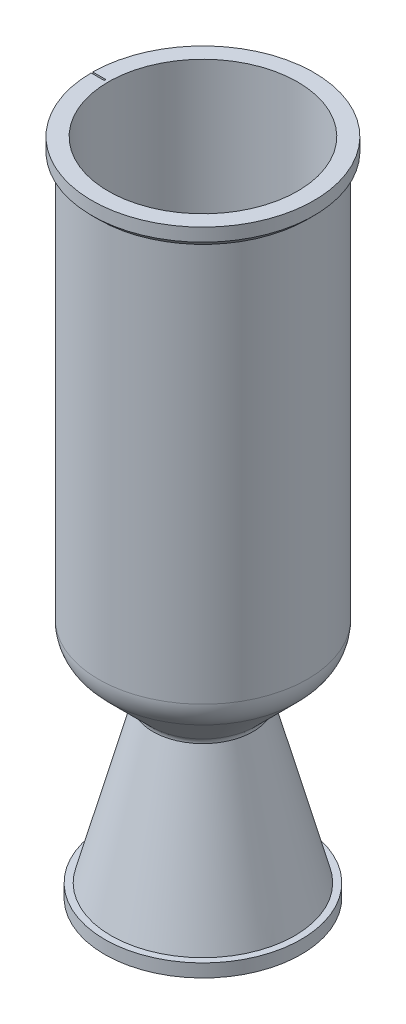
ISO-10303-21;
HEADER;
FILE_DESCRIPTION(('STEP AP214'),'2;1');
FILE_NAME('part.step','',(''),(''),'','','');
FILE_SCHEMA(('AUTOMOTIVE_DESIGN { 1 0 10303 214 1 1 1 1 }'));
ENDSEC;
DATA;
#1=APPLICATION_CONTEXT('core data for automotive mechanical design processes');
#2=APPLICATION_PROTOCOL_DEFINITION('international standard','automotive_design',2000,#1);
#3=PRODUCT_CONTEXT('',#1,'mechanical');
#4=PRODUCT('Part','Part','',(#3));
#5=PRODUCT_RELATED_PRODUCT_CATEGORY('part','',(#4));
#6=PRODUCT_DEFINITION_FORMATION('','',#4);
#7=PRODUCT_DEFINITION_CONTEXT('part definition',#1,'design');
#8=PRODUCT_DEFINITION('design','',#6,#7);
#9=PRODUCT_DEFINITION_SHAPE('','',#8);
#10=(LENGTH_UNIT() NAMED_UNIT(*) SI_UNIT(.MILLI.,.METRE.));
#11=(NAMED_UNIT(*) PLANE_ANGLE_UNIT() SI_UNIT($,.RADIAN.));
#12=(NAMED_UNIT(*) SI_UNIT($,.STERADIAN.) SOLID_ANGLE_UNIT());
#13=UNCERTAINTY_MEASURE_WITH_UNIT(LENGTH_MEASURE(1.E-05),#10,'distance_accuracy_value','');
#14=(GEOMETRIC_REPRESENTATION_CONTEXT(3) GLOBAL_UNCERTAINTY_ASSIGNED_CONTEXT((#13)) GLOBAL_UNIT_ASSIGNED_CONTEXT((#10,
#11,#12)) REPRESENTATION_CONTEXT('',''));
#15=CARTESIAN_POINT('',(0.,0.,0.));
#16=DIRECTION('',(0.,0.,1.));
#17=DIRECTION('',(1.,0.,0.));
#18=AXIS2_PLACEMENT_3D('',#15,#16,#17);
#19=CARTESIAN_POINT('',(-50.8,0.,0.));
#20=DIRECTION('',(0.,-1.,0.));
#21=DIRECTION('',(0.,0.,-1.));
#22=AXIS2_PLACEMENT_3D('',#19,#20,#21);
#23=PLANE('',#22);
#24=DIRECTION('',(0.,0.,-1.));
#25=VECTOR('',#24,1.);
#26=CARTESIAN_POINT('',(-47.625,0.,-0.40005));
#27=LINE('',#26,#25);
#28=CARTESIAN_POINT('',(-47.625,0.,0.40005));
#29=VERTEX_POINT('',#28);
#30=CARTESIAN_POINT('',(-47.625,0.,-0.40005));
#31=VERTEX_POINT('',#30);
#32=EDGE_CURVE('E561',#29,#31,#27,.T.);
#33=ORIENTED_EDGE('',*,*,#32,.F.);
#34=DIRECTION('',(1.,0.,0.));
#35=VECTOR('',#34,1.);
#36=CARTESIAN_POINT('',(-73.025,0.,0.40005));
#37=LINE('',#36,#35);
#38=CARTESIAN_POINT('',(-53.9735174414036,0.,0.40005));
#39=VERTEX_POINT('',#38);
#40=EDGE_CURVE('E464',#39,#29,#37,.T.);
#41=ORIENTED_EDGE('',*,*,#40,.F.);
#42=CARTESIAN_POINT('',(0.,0.,0.));
#43=DIRECTION('',(0.,-1.,0.));
#44=DIRECTION('',(0.,0.,-1.));
#45=AXIS2_PLACEMENT_3D('',#42,#43,#44);
#46=CIRCLE('',#45,53.975);
#47=CARTESIAN_POINT('',(-53.9735174414036,0.,-0.40005));
#48=VERTEX_POINT('',#47);
#49=EDGE_CURVE('E558',#48,#39,#46,.T.);
#50=ORIENTED_EDGE('',*,*,#49,.F.);
#51=DIRECTION('',(-1.,0.,0.));
#52=VECTOR('',#51,1.);
#53=CARTESIAN_POINT('',(-73.025,0.,-0.40005));
#54=LINE('',#53,#52);
#55=EDGE_CURVE('E496',#31,#48,#54,.T.);
#56=ORIENTED_EDGE('',*,*,#55,.F.);
#57=EDGE_LOOP('',(#33,#41,#50,#56));
#58=FACE_BOUND('',#57,.T.);
#59=CARTESIAN_POINT('',(0.,0.,0.));
#60=DIRECTION('',(0.,-1.,0.));
#61=DIRECTION('',(0.,0.,-1.));
#62=AXIS2_PLACEMENT_3D('',#59,#60,#61);
#63=CIRCLE('',#62,46.0375);
#64=CARTESIAN_POINT('',(0.,0.,-46.0375));
#65=VERTEX_POINT('',#64);
#66=EDGE_CURVE('E654',#65,#65,#63,.T.);
#67=ORIENTED_EDGE('',*,*,#66,.T.);
#68=EDGE_LOOP('',(#67));
#69=FACE_BOUND('',#68,.T.);
#70=ADVANCED_FACE('F279',(#58,#69),#23,.F.);
#71=CARTESIAN_POINT('',(0.,0.,0.));
#72=DIRECTION('',(0.,-1.,0.));
#73=DIRECTION('',(0.,0.,-1.));
#74=AXIS2_PLACEMENT_3D('',#71,#72,#73);
#75=CYLINDRICAL_SURFACE('',#74,53.975);
#76=ORIENTED_EDGE('',*,*,#49,.T.);
#77=DIRECTION('',(0.,-1.,0.));
#78=VECTOR('',#77,1.);
#79=CARTESIAN_POINT('',(-53.9735174414036,0.,0.40005));
#80=LINE('',#79,#78);
#81=CARTESIAN_POINT('',(-53.9735174414036,-6.35,0.40005));
#82=VERTEX_POINT('',#81);
#83=EDGE_CURVE('E860',#39,#82,#80,.T.);
#84=ORIENTED_EDGE('',*,*,#83,.T.);
#85=CARTESIAN_POINT('',(0.,-6.35,0.));
#86=DIRECTION('',(0.,-1.,0.));
#87=DIRECTION('',(0.,0.,-1.));
#88=AXIS2_PLACEMENT_3D('',#85,#86,#87);
#89=CIRCLE('',#88,53.975);
#90=CARTESIAN_POINT('',(-53.9735174414036,-6.35,-0.40005));
#91=VERTEX_POINT('',#90);
#92=EDGE_CURVE('E595',#91,#82,#89,.T.);
#93=ORIENTED_EDGE('',*,*,#92,.F.);
#94=DIRECTION('',(0.,-1.,0.));
#95=VECTOR('',#94,1.);
#96=CARTESIAN_POINT('',(-53.9735174414036,0.,-0.40005));
#97=LINE('',#96,#95);
#98=EDGE_CURVE('E507',#91,#48,#97,.F.);
#99=ORIENTED_EDGE('',*,*,#98,.T.);
#100=EDGE_LOOP('',(#76,#84,#93,#99));
#101=FACE_BOUND('',#100,.T.);
#102=ADVANCED_FACE('F698',(#101),#75,.T.);
#103=CARTESIAN_POINT('',(0.,-6.35,0.));
#104=DIRECTION('',(0.,1.,0.));
#105=DIRECTION('',(0.,0.,1.));
#106=AXIS2_PLACEMENT_3D('',#103,#104,#105);
#107=CONICAL_SURFACE('',#106,53.975,0.78539816339745);
#108=ORIENTED_EDGE('',*,*,#92,.T.);
#109=CARTESIAN_POINT('',(-53.9737174468973,-6.3498,0.40005));
#110=CARTESIAN_POINT('',(-53.4444691359495,-6.87903380146529,0.40005));
#111=CARTESIAN_POINT('',(-52.9152205909425,-7.40826736886461,0.40005));
#112=CARTESIAN_POINT('',(-51.8567230328103,-8.46673403553127,0.40005));
#113=CARTESIAN_POINT('',(-51.3274740196851,-8.99596713479862,0.40005));
#114=CARTESIAN_POINT('',(-50.7982247725007,-9.52519999999998,0.40005));
#115=B_SPLINE_CURVE_WITH_KNOTS('',3,(#109,#110,#111,#112,#113,#114),.UNSPECIFIED.,.F.,.F.,(4,2,
4),(0.,2.24537963856616,4.49075927713234),.UNSPECIFIED.);
#116=CARTESIAN_POINT('',(-50.7984247787025,-9.52499999999998,0.40005));
#117=VERTEX_POINT('',#116);
#118=EDGE_CURVE('E855',#82,#117,#115,.T.);
#119=ORIENTED_EDGE('',*,*,#118,.T.);
#120=CARTESIAN_POINT('',(0.,-9.52499999999998,0.));
#121=DIRECTION('',(0.,-1.,0.));
#122=DIRECTION('',(0.,0.,-1.));
#123=AXIS2_PLACEMENT_3D('',#120,#121,#122);
#124=CIRCLE('',#123,50.8);
#125=CARTESIAN_POINT('',(-50.7984247787025,-9.52499999999998,-0.40005));
#126=VERTEX_POINT('',#125);
#127=EDGE_CURVE('E592',#126,#117,#124,.T.);
#128=ORIENTED_EDGE('',*,*,#127,.F.);
#129=CARTESIAN_POINT('',(-50.7982247725007,-9.52519999999998,-0.40005));
#130=CARTESIAN_POINT('',(-51.3274740196851,-8.99596713479862,-0.40005));
#131=CARTESIAN_POINT('',(-51.8567230328103,-8.46673403553127,-0.40005));
#132=CARTESIAN_POINT('',(-52.9152205909425,-7.40826736886461,-0.40005));
#133=CARTESIAN_POINT('',(-53.4444691359495,-6.87903380146529,-0.40005));
#134=CARTESIAN_POINT('',(-53.9737174468972,-6.34979999999999,-0.40005));
#135=B_SPLINE_CURVE_WITH_KNOTS('',3,(#129,#130,#131,#132,#133,#134),.UNSPECIFIED.,.F.,.F.,(4,2,
4),(0.,2.24537963856619,4.49075927713234),.UNSPECIFIED.);
#136=EDGE_CURVE('E495',#126,#91,#135,.T.);
#137=ORIENTED_EDGE('',*,*,#136,.T.);
#138=EDGE_LOOP('',(#108,#119,#128,#137));
#139=FACE_BOUND('',#138,.T.);
#140=ADVANCED_FACE('F509',(#139),#107,.T.);
#141=CARTESIAN_POINT('',(0.,0.,0.));
#142=DIRECTION('',(0.,-1.,0.));
#143=DIRECTION('',(0.,0.,-1.));
#144=AXIS2_PLACEMENT_3D('',#141,#142,#143);
#145=CYLINDRICAL_SURFACE('',#144,50.8);
#146=ORIENTED_EDGE('',*,*,#127,.T.);
#147=DIRECTION('',(0.,-1.,0.));
#148=VECTOR('',#147,1.);
#149=CARTESIAN_POINT('',(-50.7984247787025,0.,0.40005));
#150=LINE('',#149,#148);
#151=CARTESIAN_POINT('',(-50.7984247787025,-203.2,0.40005));
#152=VERTEX_POINT('',#151);
#153=EDGE_CURVE('E863',#117,#152,#150,.T.);
#154=ORIENTED_EDGE('',*,*,#153,.T.);
#155=CARTESIAN_POINT('',(0.,-203.2,0.));
#156=DIRECTION('',(0.,-1.,0.));
#157=DIRECTION('',(0.,0.,-1.));
#158=AXIS2_PLACEMENT_3D('',#155,#156,#157);
#159=CIRCLE('',#158,50.8);
#160=CARTESIAN_POINT('',(-50.7984247787025,-203.2,-0.40005));
#161=VERTEX_POINT('',#160);
#162=EDGE_CURVE('E591',#161,#152,#159,.T.);
#163=ORIENTED_EDGE('',*,*,#162,.F.);
#164=DIRECTION('',(0.,-1.,0.));
#165=VECTOR('',#164,1.);
#166=CARTESIAN_POINT('',(-50.7984247787025,0.,-0.40005));
#167=LINE('',#166,#165);
#168=EDGE_CURVE('E487',#161,#126,#167,.F.);
#169=ORIENTED_EDGE('',*,*,#168,.T.);
#170=EDGE_LOOP('',(#146,#154,#163,#169));
#171=FACE_BOUND('',#170,.T.);
#172=ADVANCED_FACE('F817',(#171),#145,.T.);
#173=CARTESIAN_POINT('',(0.,-203.2,0.));
#174=DIRECTION('',(0.,-1.,0.));
#175=DIRECTION('',(0.,0.,-1.));
#176=AXIS2_PLACEMENT_3D('',#173,#174,#175);
#177=TOROIDAL_SURFACE('',#176,33.3375,17.4625);
#178=ORIENTED_EDGE('',*,*,#162,.T.);
#179=CARTESIAN_POINT('',(-50.7984247775572,-203.1998,0.40005));
#180=CARTESIAN_POINT('',(-50.7984273598393,-203.445200807657,0.40005));
#181=CARTESIAN_POINT('',(-50.7932564958226,-203.690571892231,0.40005));
#182=CARTESIAN_POINT('',(-50.7725810029572,-204.180877534805,0.40005));
#183=CARTESIAN_POINT('',(-50.757076405534,-204.42581209413,0.40005));
#184=CARTESIAN_POINT('',(-50.6950912276589,-205.159284362763,0.40005));
#185=CARTESIAN_POINT('',(-50.633139249546,-205.646604659389,0.40005));
#186=CARTESIAN_POINT('',(-50.4683633623392,-206.614585744662,0.40005));
#187=CARTESIAN_POINT('',(-50.3655097384907,-207.095241428213,0.40005));
#188=CARTESIAN_POINT('',(-50.1196658979252,-208.046168499435,0.40005));
#189=CARTESIAN_POINT('',(-49.9766776773565,-208.516440402302,0.40005));
#190=CARTESIAN_POINT('',(-49.6514777943938,-209.443551915955,0.40005));
#191=CARTESIAN_POINT('',(-49.4692412254066,-209.900382786994,0.40005));
#192=CARTESIAN_POINT('',(-49.0668666363118,-210.797114597889,0.40005));
#193=CARTESIAN_POINT('',(-48.8467235443986,-211.237013262604,0.40005));
#194=CARTESIAN_POINT('',(-48.3705796235854,-212.095860665071,0.40005));
#195=CARTESIAN_POINT('',(-48.1146469539893,-212.514847217436,0.40005));
#196=CARTESIAN_POINT('',(-47.5685247226421,-213.329625432189,0.40005));
#197=CARTESIAN_POINT('',(-47.2783517900827,-213.725428215424,0.40005));
#198=CARTESIAN_POINT('',(-46.7706737667308,-214.360053696771,0.40005));
#199=CARTESIAN_POINT('',(-46.5622936107217,-214.606234945493,0.40005));
#200=CARTESIAN_POINT('',(-46.1325080497984,-215.086378531416,0.40005));
#201=CARTESIAN_POINT('',(-45.911119838235,-215.320356258929,0.40005));
#202=CARTESIAN_POINT('',(-45.683400575866,-215.54805216647,0.40005));
#203=B_SPLINE_CURVE_WITH_KNOTS('',3,(#179,#180,#181,#182,#183,#184,#185,#186,#187,#188,#189,
#190,#191,#192,#193,#194,#195,#196,#197,#198,#199,#200,#201,#202),.UNSPECIFIED.,.F.,.F.,(4,2,2,
2,2,2,2,2,2,2,2,4),(0.,0.736088425401798,1.47217461233222,2.94400609446072,4.41690881086295,
5.88973828343773,7.36350516676375,8.83746939014749,10.3086638189989,11.7791466629432,
12.7462857909962,13.7121741711617),.UNSPECIFIED.);
#204=CARTESIAN_POINT('',(-45.6836005867739,-215.54785216647,0.40005));
#205=VERTEX_POINT('',#204);
#206=EDGE_CURVE('E647',#152,#205,#203,.T.);
#207=ORIENTED_EDGE('',*,*,#206,.T.);
#208=CARTESIAN_POINT('',(0.,-215.54785216647,0.));
#209=DIRECTION('',(0.,-1.,0.));
#210=DIRECTION('',(0.,0.,-1.));
#211=AXIS2_PLACEMENT_3D('',#208,#209,#210);
#212=CIRCLE('',#211,45.6853521664701);
#213=CARTESIAN_POINT('',(-45.6836005867739,-215.54785216647,-0.40005));
#214=VERTEX_POINT('',#213);
#215=EDGE_CURVE('E584',#214,#205,#212,.T.);
#216=ORIENTED_EDGE('',*,*,#215,.F.);
#217=CARTESIAN_POINT('',(-45.683400575866,-215.54805216647,-0.40005));
#218=CARTESIAN_POINT('',(-45.856933255503,-215.374531438434,-0.40005));
#219=CARTESIAN_POINT('',(-46.0267868832316,-215.197373515004,-0.40005));
#220=CARTESIAN_POINT('',(-46.3588786530026,-214.836059145697,-0.40005));
#221=CARTESIAN_POINT('',(-46.5211168180421,-214.651902720957,-0.40005));
#222=CARTESIAN_POINT('',(-46.9959503316718,-214.089434665709,-0.40005));
#223=CARTESIAN_POINT('',(-47.2967452405747,-213.701043699248,-0.40005));
#224=CARTESIAN_POINT('',(-47.8647262912441,-212.900068296628,-0.40005));
#225=CARTESIAN_POINT('',(-48.1318877573391,-212.487466419409,-0.40005));
#226=CARTESIAN_POINT('',(-48.630487082456,-211.641223346573,-0.40005));
#227=CARTESIAN_POINT('',(-48.8619267189964,-211.207583199232,-0.40005));
#228=CARTESIAN_POINT('',(-49.2875726047445,-210.32206399554,-0.40005));
#229=CARTESIAN_POINT('',(-49.4817550295167,-209.870173490902,-0.40005));
#230=CARTESIAN_POINT('',(-49.8313473593728,-208.951561866793,-0.40005));
#231=CARTESIAN_POINT('',(-49.9867520681156,-208.484838769141,-0.40005));
#232=CARTESIAN_POINT('',(-50.2573909097526,-207.540850081516,-0.40005));
#233=CARTESIAN_POINT('',(-50.3727000095298,-207.063605959605,-0.40005));
#234=CARTESIAN_POINT('',(-50.5626918739294,-206.101294456154,-0.40005));
#235=CARTESIAN_POINT('',(-50.6373942646959,-205.616230970827,-0.40005));
#236=CARTESIAN_POINT('',(-50.7271722035849,-204.808522361168,-0.40005));
#237=CARTESIAN_POINT('',(-50.7539057309963,-204.487126723249,-0.40005));
#238=CARTESIAN_POINT('',(-50.7895249076014,-203.843764884781,-0.40005));
#239=CARTESIAN_POINT('',(-50.7984335873801,-203.521799959133,-0.40005));
#240=CARTESIAN_POINT('',(-50.7984247775572,-203.1998,-0.40005));
#241=B_SPLINE_CURVE_WITH_KNOTS('',3,(#217,#218,#219,#220,#221,#222,#223,#224,#225,#226,#227,
#228,#229,#230,#231,#232,#233,#234,#235,#236,#237,#238,#239,#240),.UNSPECIFIED.,.F.,.F.,(4,2,2,
2,2,2,2,2,2,2,2,4),(0.,0.736097462701431,1.47219270238894,2.94404254138745,4.41696600845904,
5.88981615919696,7.36360502006074,8.83759126753361,10.3088065897984,11.7793102066277,
12.7463673003212,13.7121740994606),.UNSPECIFIED.);
#242=EDGE_CURVE('E629',#214,#161,#241,.T.);
#243=ORIENTED_EDGE('',*,*,#242,.T.);
#244=EDGE_LOOP('',(#178,#207,#216,#243));
#245=FACE_BOUND('',#244,.T.);
#246=ADVANCED_FACE('F635',(#245),#177,.T.);
#247=CARTESIAN_POINT('',(0.,-215.54785216647,0.));
#248=DIRECTION('',(0.,1.,0.));
#249=DIRECTION('',(0.,0.,1.));
#250=AXIS2_PLACEMENT_3D('',#247,#248,#249);
#251=CONICAL_SURFACE('',#250,45.6853521664701,0.785398163397451);
#252=ORIENTED_EDGE('',*,*,#215,.T.);
#253=CARTESIAN_POINT('',(-45.6838005944422,-215.54765216647,0.40005));
#254=CARTESIAN_POINT('',(-42.3242460940695,-218.907106650396,0.40005));
#255=CARTESIAN_POINT('',(-38.9646589710789,-222.266528509466,0.40005));
#256=CARTESIAN_POINT('',(-32.2454194796825,-228.985306978071,0.40005));
#257=CARTESIAN_POINT('',(-28.8857671112767,-232.344663587607,0.40005));
#258=CARTESIAN_POINT('',(-25.526082120253,-235.703987572287,0.40005));
#259=B_SPLINE_CURVE_WITH_KNOTS('',3,(#253,#254,#255,#256,#257,#258),.UNSPECIFIED.,.F.,.F.,(4,2,
4),(0.,14.2531704465157,28.5063408937923),.UNSPECIFIED.);
#260=CARTESIAN_POINT('',(-25.5262821448131,-235.703787572287,0.40005));
#261=VERTEX_POINT('',#260);
#262=EDGE_CURVE('E305',#205,#261,#259,.T.);
#263=ORIENTED_EDGE('',*,*,#262,.T.);
#264=CARTESIAN_POINT('',(0.,-235.703787572287,0.));
#265=DIRECTION('',(0.,-1.,0.));
#266=DIRECTION('',(0.,0.,-1.));
#267=AXIS2_PLACEMENT_3D('',#264,#265,#266);
#268=CIRCLE('',#267,25.5294167606528);
#269=CARTESIAN_POINT('',(-25.5262821448131,-235.703787572287,-0.40005));
#270=VERTEX_POINT('',#269);
#271=EDGE_CURVE('E579',#270,#261,#268,.T.);
#272=ORIENTED_EDGE('',*,*,#271,.F.);
#273=CARTESIAN_POINT('',(-25.526082120253,-235.703987572287,-0.40005));
#274=CARTESIAN_POINT('',(-28.8857671112767,-232.344663587607,-0.40005));
#275=CARTESIAN_POINT('',(-32.2454194796825,-228.985306978071,-0.40005));
#276=CARTESIAN_POINT('',(-38.9646589710789,-222.266528509466,-0.40005));
#277=CARTESIAN_POINT('',(-42.3242460940695,-218.907106650396,-0.40005));
#278=CARTESIAN_POINT('',(-45.6838005944422,-215.54765216647,-0.40005));
#279=B_SPLINE_CURVE_WITH_KNOTS('',3,(#273,#274,#275,#276,#277,#278),.UNSPECIFIED.,.F.,.F.,(4,2,
4),(0.,14.2531704472766,28.5063408937923),.UNSPECIFIED.);
#280=EDGE_CURVE('E621',#270,#214,#279,.T.);
#281=ORIENTED_EDGE('',*,*,#280,.T.);
#282=EDGE_LOOP('',(#252,#263,#272,#281));
#283=FACE_BOUND('',#282,.T.);
#284=ADVANCED_FACE('F630',(#283),#251,.T.);
#285=CARTESIAN_POINT('',(0.,-238.622370811635,0.));
#286=DIRECTION('',(0.,-1.,0.));
#287=DIRECTION('',(0.,0.,-1.));
#288=AXIS2_PLACEMENT_3D('',#285,#286,#287);
#289=TOROIDAL_SURFACE('',#288,28.4480000000006,4.12750000000045);
#290=ORIENTED_EDGE('',*,*,#271,.T.);
#291=CARTESIAN_POINT('',(-25.5264821830807,-235.703587572287,0.40005));
#292=CARTESIAN_POINT('',(-25.4444550090512,-235.785575872215,0.40005));
#293=CARTESIAN_POINT('',(-25.36590206334,-235.87103669319,0.40005));
#294=CARTESIAN_POINT('',(-25.2162611295792,-236.048261129075,0.40005));
#295=CARTESIAN_POINT('',(-25.1451731087012,-236.140024716263,0.40005));
#296=CARTESIAN_POINT('',(-25.0109024341637,-236.329319412589,0.40005));
#297=CARTESIAN_POINT('',(-24.9477287491121,-236.426856883775,0.40005));
#298=CARTESIAN_POINT('',(-24.8298303017649,-236.626903673404,0.40005));
#299=CARTESIAN_POINT('',(-24.7751050726461,-236.729412716729,0.40005));
#300=CARTESIAN_POINT('',(-24.6744548753479,-236.938751371474,0.40005));
#301=CARTESIAN_POINT('',(-24.6285360515213,-237.045583936993,0.40005));
#302=CARTESIAN_POINT('',(-24.5458735519063,-237.262741744724,0.40005));
#303=CARTESIAN_POINT('',(-24.5091297962523,-237.373066956525,0.40005));
#304=CARTESIAN_POINT('',(-24.4451476540233,-237.596181362785,0.40005));
#305=CARTESIAN_POINT('',(-24.4178891932017,-237.708964810148,0.40005));
#306=CARTESIAN_POINT('',(-24.3729738870616,-237.936378893046,0.40005));
#307=CARTESIAN_POINT('',(-24.3553117745929,-238.051008479642,0.40005));
#308=CARTESIAN_POINT('',(-24.3362658774069,-238.222229876889,0.40005));
#309=CARTESIAN_POINT('',(-24.3311793096256,-238.278432039097,0.40005));
#310=CARTESIAN_POINT('',(-24.3233187919061,-238.390934518363,0.40005));
#311=CARTESIAN_POINT('',(-24.3205422548079,-238.447234654654,0.40005));
#312=CARTESIAN_POINT('',(-24.3189197025477,-238.50357483423,0.40005));
#313=B_SPLINE_CURVE_WITH_KNOTS('',3,(#291,#292,#293,#294,#295,#296,#297,#298,#299,#300,#301,
#302,#303,#304,#305,#306,#307,#308,#309,#310,#311,#312),.UNSPECIFIED.,.F.,.F.,(4,2,2,2,2,2,2,2,
2,2,4),(0.,0.347823263570365,0.695644997455144,1.04385738816888,1.39205053135386,
1.74048573693458,2.08891790940096,2.43660812582452,2.78410731215096,2.95336232112874,
3.12242751381006),.UNSPECIFIED.);
#314=CARTESIAN_POINT('',(-24.318925466881,-238.50337483423,0.40005));
#315=VERTEX_POINT('',#314);
#316=EDGE_CURVE('E648',#261,#315,#313,.T.);
#317=ORIENTED_EDGE('',*,*,#316,.T.);
#318=CARTESIAN_POINT('',(0.,-238.50337483423,0.));
#319=DIRECTION('',(0.,-1.,0.));
#320=DIRECTION('',(0.,0.,-1.));
#321=AXIS2_PLACEMENT_3D('',#318,#319,#320);
#322=CIRCLE('',#321,24.3222156857926);
#323=CARTESIAN_POINT('',(-24.318925466881,-238.50337483423,-0.40005));
#324=VERTEX_POINT('',#323);
#325=EDGE_CURVE('E577',#324,#315,#322,.T.);
#326=ORIENTED_EDGE('',*,*,#325,.F.);
#327=CARTESIAN_POINT('',(-24.3189197025477,-238.50357483423,-0.40005));
#328=CARTESIAN_POINT('',(-24.3222454963228,-238.387653503245,-0.40005));
#329=CARTESIAN_POINT('',(-24.330481723854,-238.271875464261,-0.40005));
#330=CARTESIAN_POINT('',(-24.3566620211788,-238.041422579136,-0.40005));
#331=CARTESIAN_POINT('',(-24.3746060385244,-237.926747727039,-0.40005));
#332=CARTESIAN_POINT('',(-24.4201142543245,-237.699189916435,-0.40005));
#333=CARTESIAN_POINT('',(-24.4476891439169,-237.586309095665,-0.40005));
#334=CARTESIAN_POINT('',(-24.5122530689118,-237.363279479543,-0.40005));
#335=CARTESIAN_POINT('',(-24.5492415863741,-237.253130534248,-0.40005));
#336=CARTESIAN_POINT('',(-24.6323995575627,-237.036267556468,-0.40005));
#337=CARTESIAN_POINT('',(-24.6785753269192,-236.929555945883,-0.40005));
#338=CARTESIAN_POINT('',(-24.7797627275241,-236.720407466424,-0.40005));
#339=CARTESIAN_POINT('',(-24.8347742833555,-236.617970561071,-0.40005));
#340=CARTESIAN_POINT('',(-24.9531117012531,-236.41831679752,-0.40005));
#341=CARTESIAN_POINT('',(-25.0164196435832,-236.321089307371,-0.40005));
#342=CARTESIAN_POINT('',(-25.15096696454,-236.132347585717,-0.40005));
#343=CARTESIAN_POINT('',(-25.2222019698208,-236.040830247002,-0.40005));
#344=CARTESIAN_POINT('',(-25.3336636416382,-235.909435345468,-0.40005));
#345=CARTESIAN_POINT('',(-25.3710675005254,-235.86713427663,-0.40005));
#346=CARTESIAN_POINT('',(-25.4475355771539,-235.784148311028,-0.40005));
#347=CARTESIAN_POINT('',(-25.4865978828329,-235.74346165238,-0.40005));
#348=CARTESIAN_POINT('',(-25.5264821830807,-235.703587572287,-0.40005));
#349=B_SPLINE_CURVE_WITH_KNOTS('',3,(#327,#328,#329,#330,#331,#332,#333,#334,#335,#336,#337,
#338,#339,#340,#341,#342,#343,#344,#345,#346,#347,#348),.UNSPECIFIED.,.F.,.F.,(4,2,2,2,2,2,2,2,
2,2,4),(0.,0.347800900801049,0.695599922570107,1.04378626627422,1.39195345681207,
1.74036082148009,2.08876521250022,2.43642910463957,2.78390213337823,2.95325998786883,
3.12242762356211),.UNSPECIFIED.);
#350=EDGE_CURVE('E297',#324,#270,#349,.T.);
#351=ORIENTED_EDGE('',*,*,#350,.T.);
#352=EDGE_LOOP('',(#290,#317,#326,#351));
#353=FACE_BOUND('',#352,.T.);
#354=ADVANCED_FACE('F634',(#353),#289,.F.);
#355=CARTESIAN_POINT('',(0.,-238.50337483423,0.));
#356=DIRECTION('',(0.,-1.,0.));
#357=DIRECTION('',(0.,0.,-1.));
#358=AXIS2_PLACEMENT_3D('',#355,#356,#357);
#359=CONICAL_SURFACE('',#358,24.3222156857926,0.261799387799143);
#360=CARTESIAN_POINT('',(-24.3188718697921,-238.50317483423,0.40005));
#361=CARTESIAN_POINT('',(-24.3295462636427,-238.543006826287,0.40005));
#362=CARTESIAN_POINT('',(-24.3402206559565,-238.582838818755,0.40005));
#363=CARTESIAN_POINT('',(-27.6894616084006,-251.080689471137,0.40005));
#364=CARTESIAN_POINT('',(-31.0278781037174,-263.538748345799,0.40005));
#365=CARTESIAN_POINT('',(-37.7872880283425,-288.763567369257,0.40005));
#366=CARTESIAN_POINT('',(-41.2082780710775,-301.530328425549,0.40005));
#367=CARTESIAN_POINT('',(-44.6292860700358,-314.297084667979,0.40005));
#368=B_SPLINE_CURVE_WITH_KNOTS('',3,(#360,#361,#362,#363,#364,#365,#366,#367),.UNSPECIFIED.,.F.,
.F.,(4,2,2,4),(0.,0.12371245886188,38.8165322122056,78.4680170072845),.UNSPECIFIED.);
#369=CARTESIAN_POINT('',(-44.6292324780444,-314.296884667979,0.40005));
#370=VERTEX_POINT('',#369);
#371=EDGE_CURVE('E13',#315,#370,#368,.T.);
#372=ORIENTED_EDGE('',*,*,#371,.T.);
#373=CARTESIAN_POINT('',(0.,-314.296884667979,0.));
#374=DIRECTION('',(0.,-1.,0.));
#375=DIRECTION('',(0.,0.,-1.));
#376=AXIS2_PLACEMENT_3D('',#373,#374,#375);
#377=CIRCLE('',#376,44.6310254372654);
#378=CARTESIAN_POINT('',(-44.6292324780444,-314.296884667979,-0.40005));
#379=VERTEX_POINT('',#378);
#380=EDGE_CURVE('E574',#379,#370,#377,.T.);
#381=ORIENTED_EDGE('',*,*,#380,.F.);
#382=CARTESIAN_POINT('',(-44.6292860700358,-314.297084667979,-0.40005));
#383=CARTESIAN_POINT('',(-41.2496338161725,-301.684661033269,-0.40005));
#384=CARTESIAN_POINT('',(-37.8699986758086,-289.072232810585,-0.40005));
#385=CARTESIAN_POINT('',(-31.1105919066572,-263.847412941564,-0.40005));
#386=CARTESIAN_POINT('',(-27.7308202778697,-251.235021295228,-0.40005));
#387=CARTESIAN_POINT('',(-24.3402206559545,-238.582838818756,-0.40005));
#388=CARTESIAN_POINT('',(-24.3295462636407,-238.543006826287,-0.40005));
#389=CARTESIAN_POINT('',(-24.3188718697921,-238.50317483423,-0.40005));
#390=B_SPLINE_CURVE_WITH_KNOTS('',3,(#382,#383,#384,#385,#386,#387,#388,#389),.UNSPECIFIED.,.F.,
.F.,(4,2,2,4),(0.,39.1721522766587,78.3443045484145,78.4680170072764),.UNSPECIFIED.);
#391=EDGE_CURVE('E289',#379,#324,#390,.T.);
#392=ORIENTED_EDGE('',*,*,#391,.T.);
#393=ORIENTED_EDGE('',*,*,#325,.T.);
#394=EDGE_LOOP('',(#372,#381,#392,#393));
#395=FACE_BOUND('',#394,.T.);
#396=ADVANCED_FACE('F606',(#395),#359,.T.);
#397=CARTESIAN_POINT('',(-47.752,-314.296884667979,0.));
#398=DIRECTION('',(0.,-1.,0.));
#399=DIRECTION('',(0.,0.,-1.));
#400=AXIS2_PLACEMENT_3D('',#397,#398,#399);
#401=PLANE('',#400);
#402=CARTESIAN_POINT('',(0.,-314.296884667979,0.));
#403=DIRECTION('',(0.,-1.,0.));
#404=DIRECTION('',(0.,0.,-1.));
#405=AXIS2_PLACEMENT_3D('',#402,#403,#404);
#406=CIRCLE('',#405,47.752);
#407=CARTESIAN_POINT('',(0.,-314.296884667979,-47.752));
#408=VERTEX_POINT('',#407);
#409=EDGE_CURVE('E571',#408,#408,#406,.T.);
#410=ORIENTED_EDGE('',*,*,#409,.F.);
#411=EDGE_LOOP('',(#410));
#412=FACE_BOUND('',#411,.T.);
#413=ORIENTED_EDGE('',*,*,#380,.T.);
#414=DIRECTION('',(-1.,0.,0.));
#415=VECTOR('',#414,1.);
#416=CARTESIAN_POINT('',(-41.3440235644592,-314.296884667979,0.40005));
#417=LINE('',#416,#415);
#418=CARTESIAN_POINT('',(-41.3440235644592,-314.296884667979,0.40005));
#419=VERTEX_POINT('',#418);
#420=EDGE_CURVE('E381',#419,#370,#417,.T.);
#421=ORIENTED_EDGE('',*,*,#420,.F.);
#422=DIRECTION('',(0.,0.,1.));
#423=VECTOR('',#422,1.);
#424=CARTESIAN_POINT('',(-41.3440235644592,-314.296884667979,-0.40005));
#425=LINE('',#424,#423);
#426=CARTESIAN_POINT('',(-41.3440235644592,-314.296884667979,-0.40005));
#427=VERTEX_POINT('',#426);
#428=EDGE_CURVE('E386',#427,#419,#425,.T.);
#429=ORIENTED_EDGE('',*,*,#428,.F.);
#430=DIRECTION('',(1.,0.,0.));
#431=VECTOR('',#430,1.);
#432=CARTESIAN_POINT('',(-41.3440235644592,-314.296884667979,-0.40005));
#433=LINE('',#432,#431);
#434=EDGE_CURVE('E369',#379,#427,#433,.T.);
#435=ORIENTED_EDGE('',*,*,#434,.F.);
#436=EDGE_LOOP('',(#413,#421,#429,#435));
#437=FACE_BOUND('',#436,.T.);
#438=ADVANCED_FACE('F388',(#412,#437),#401,.F.);
#439=CARTESIAN_POINT('',(0.,0.,0.));
#440=DIRECTION('',(0.,-1.,0.));
#441=DIRECTION('',(0.,0.,-1.));
#442=AXIS2_PLACEMENT_3D('',#439,#440,#441);
#443=CYLINDRICAL_SURFACE('',#442,47.752);
#444=CARTESIAN_POINT('',(0.,-320.646884667979,0.));
#445=DIRECTION('',(0.,-1.,0.));
#446=DIRECTION('',(0.,0.,-1.));
#447=AXIS2_PLACEMENT_3D('',#444,#445,#446);
#448=CIRCLE('',#447,47.752);
#449=CARTESIAN_POINT('',(0.,-320.646884667979,-47.752));
#450=VERTEX_POINT('',#449);
#451=EDGE_CURVE('E575',#450,#450,#448,.T.);
#452=ORIENTED_EDGE('',*,*,#451,.F.);
#453=EDGE_LOOP('',(#452));
#454=FACE_BOUND('',#453,.T.);
#455=ORIENTED_EDGE('',*,*,#409,.T.);
#456=EDGE_LOOP('',(#455));
#457=FACE_BOUND('',#456,.T.);
#458=ADVANCED_FACE('F686',(#454,#457),#443,.T.);
#459=CARTESIAN_POINT('',(-41.402,-320.646884667979,0.));
#460=DIRECTION('',(0.,1.,0.));
#461=DIRECTION('',(0.,0.,1.));
#462=AXIS2_PLACEMENT_3D('',#459,#460,#461);
#463=PLANE('',#462);
#464=CARTESIAN_POINT('',(0.,-320.646884667979,0.));
#465=DIRECTION('',(0.,-1.,0.));
#466=DIRECTION('',(0.,0.,-1.));
#467=AXIS2_PLACEMENT_3D('',#464,#465,#466);
#468=CIRCLE('',#467,41.402);
#469=CARTESIAN_POINT('',(0.,-320.646884667979,-41.402));
#470=VERTEX_POINT('',#469);
#471=EDGE_CURVE('E677',#470,#470,#468,.T.);
#472=ORIENTED_EDGE('',*,*,#471,.F.);
#473=EDGE_LOOP('',(#472));
#474=FACE_BOUND('',#473,.T.);
#475=ORIENTED_EDGE('',*,*,#451,.T.);
#476=EDGE_LOOP('',(#475));
#477=FACE_BOUND('',#476,.T.);
#478=ADVANCED_FACE('F684',(#474,#477),#463,.F.);
#479=CARTESIAN_POINT('',(0.,-320.646884667979,0.));
#480=DIRECTION('',(0.,-1.,0.));
#481=DIRECTION('',(0.,0.,-1.));
#482=AXIS2_PLACEMENT_3D('',#479,#480,#481);
#483=CONICAL_SURFACE('',#482,41.402,0.261799387799142);
#484=CARTESIAN_POINT('',(0.,-239.608471373476,0.));
#485=DIRECTION('',(0.,-1.,0.));
#486=DIRECTION('',(0.,0.,-1.));
#487=AXIS2_PLACEMENT_3D('',#484,#485,#486);
#488=CIRCLE('',#487,19.6878226018389);
#489=CARTESIAN_POINT('',(0.,-239.608471373476,-19.6878226018389));
#490=VERTEX_POINT('',#489);
#491=EDGE_CURVE('E675',#490,#490,#488,.T.);
#492=ORIENTED_EDGE('',*,*,#491,.F.);
#493=EDGE_LOOP('',(#492));
#494=FACE_BOUND('',#493,.T.);
#495=ORIENTED_EDGE('',*,*,#471,.T.);
#496=EDGE_LOOP('',(#495));
#497=FACE_BOUND('',#496,.T.);
#498=ADVANCED_FACE('F734',(#494,#497),#483,.F.);
#499=CARTESIAN_POINT('',(0.,-238.622370811635,0.));
#500=DIRECTION('',(0.,-1.,0.));
#501=DIRECTION('',(0.,0.,-1.));
#502=AXIS2_PLACEMENT_3D('',#499,#500,#501);
#503=TOROIDAL_SURFACE('',#502,23.3679999999997,3.80999999999936);
#504=CARTESIAN_POINT('',(0.,-238.622370811635,0.));
#505=DIRECTION('',(0.,-1.,0.));
#506=DIRECTION('',(0.,0.,-1.));
#507=AXIS2_PLACEMENT_3D('',#504,#505,#506);
#508=CIRCLE('',#507,19.5580000000002);
#509=CARTESIAN_POINT('',(0.,-238.622370811635,-19.5580000000002));
#510=VERTEX_POINT('',#509);
#511=EDGE_CURVE('E672',#510,#510,#508,.T.);
#512=ORIENTED_EDGE('',*,*,#511,.F.);
#513=EDGE_LOOP('',(#512));
#514=FACE_BOUND('',#513,.T.);
#515=ORIENTED_EDGE('',*,*,#491,.T.);
#516=EDGE_LOOP('',(#515));
#517=FACE_BOUND('',#516,.T.);
#518=ADVANCED_FACE('F728',(#514,#517),#503,.T.);
#519=CARTESIAN_POINT('',(0.,-238.622370811635,0.));
#520=DIRECTION('',(0.,-1.,0.));
#521=DIRECTION('',(0.,0.,-1.));
#522=AXIS2_PLACEMENT_3D('',#519,#520,#521);
#523=TOROIDAL_SURFACE('',#522,28.4480000000006,8.89000000000035);
#524=CARTESIAN_POINT('',(0.,-232.336191526886,0.));
#525=DIRECTION('',(0.,-1.,0.));
#526=DIRECTION('',(0.,0.,-1.));
#527=AXIS2_PLACEMENT_3D('',#524,#525,#526);
#528=CIRCLE('',#527,22.1618207152519);
#529=CARTESIAN_POINT('',(0.,-232.336191526886,-22.1618207152519));
#530=VERTEX_POINT('',#529);
#531=EDGE_CURVE('E669',#530,#530,#528,.T.);
#532=ORIENTED_EDGE('',*,*,#531,.F.);
#533=EDGE_LOOP('',(#532));
#534=FACE_BOUND('',#533,.T.);
#535=ORIENTED_EDGE('',*,*,#511,.T.);
#536=EDGE_LOOP('',(#535));
#537=FACE_BOUND('',#536,.T.);
#538=ADVANCED_FACE('F722',(#534,#537),#523,.T.);
#539=CARTESIAN_POINT('',(0.,-232.336191526886,0.));
#540=DIRECTION('',(0.,1.,0.));
#541=DIRECTION('',(0.,0.,1.));
#542=AXIS2_PLACEMENT_3D('',#539,#540,#541);
#543=CONICAL_SURFACE('',#542,22.1618207152519,0.785398163397452);
#544=CARTESIAN_POINT('',(0.,-212.180256121069,0.));
#545=DIRECTION('',(0.,-1.,0.));
#546=DIRECTION('',(0.,0.,-1.));
#547=AXIS2_PLACEMENT_3D('',#544,#545,#546);
#548=CIRCLE('',#547,42.3177561210692);
#549=CARTESIAN_POINT('',(0.,-212.180256121069,-42.3177561210692));
#550=VERTEX_POINT('',#549);
#551=EDGE_CURVE('E666',#550,#550,#548,.T.);
#552=ORIENTED_EDGE('',*,*,#551,.F.);
#553=EDGE_LOOP('',(#552));
#554=FACE_BOUND('',#553,.T.);
#555=ORIENTED_EDGE('',*,*,#531,.T.);
#556=EDGE_LOOP('',(#555));
#557=FACE_BOUND('',#556,.T.);
#558=ADVANCED_FACE('F717',(#554,#557),#543,.F.);
#559=CARTESIAN_POINT('',(0.,-203.2,0.));
#560=DIRECTION('',(0.,-1.,0.));
#561=DIRECTION('',(0.,0.,-1.));
#562=AXIS2_PLACEMENT_3D('',#559,#560,#561);
#563=TOROIDAL_SURFACE('',#562,33.3375,12.7);
#564=CARTESIAN_POINT('',(0.,-203.2,0.));
#565=DIRECTION('',(0.,-1.,0.));
#566=DIRECTION('',(0.,0.,-1.));
#567=AXIS2_PLACEMENT_3D('',#564,#565,#566);
#568=CIRCLE('',#567,46.0375);
#569=CARTESIAN_POINT('',(0.,-203.2,-46.0375));
#570=VERTEX_POINT('',#569);
#571=EDGE_CURVE('E663',#570,#570,#568,.T.);
#572=ORIENTED_EDGE('',*,*,#571,.F.);
#573=EDGE_LOOP('',(#572));
#574=FACE_BOUND('',#573,.T.);
#575=ORIENTED_EDGE('',*,*,#551,.T.);
#576=EDGE_LOOP('',(#575));
#577=FACE_BOUND('',#576,.T.);
#578=ADVANCED_FACE('F712',(#574,#577),#563,.F.);
#579=CARTESIAN_POINT('',(0.,0.,0.));
#580=DIRECTION('',(0.,-1.,0.));
#581=DIRECTION('',(0.,0.,-1.));
#582=AXIS2_PLACEMENT_3D('',#579,#580,#581);
#583=CYLINDRICAL_SURFACE('',#582,46.0375);
#584=ORIENTED_EDGE('',*,*,#66,.F.);
#585=EDGE_LOOP('',(#584));
#586=FACE_BOUND('',#585,.T.);
#587=ORIENTED_EDGE('',*,*,#571,.T.);
#588=EDGE_LOOP('',(#587));
#589=FACE_BOUND('',#588,.T.);
#590=ADVANCED_FACE('F611',(#586,#589),#583,.F.);
#591=CARTESIAN_POINT('',(-46.5455000000001,-238.622370811635,0.40005));
#592=DIRECTION('',(0.,0.,1.));
#593=DIRECTION('',(1.,0.,0.));
#594=AXIS2_PLACEMENT_3D('',#591,#592,#593);
#595=PLANE('',#594);
#596=ORIENTED_EDGE('',*,*,#206,.F.);
#597=ORIENTED_EDGE('',*,*,#153,.F.);
#598=ORIENTED_EDGE('',*,*,#118,.F.);
#599=ORIENTED_EDGE('',*,*,#83,.F.);
#600=ORIENTED_EDGE('',*,*,#40,.T.);
#601=CARTESIAN_POINT('',(-47.625,-203.2,0.40005));
#602=CARTESIAN_POINT('',(-47.625,-135.466666666667,0.40005));
#603=CARTESIAN_POINT('',(-47.625,-67.7333333333333,0.40005));
#604=CARTESIAN_POINT('',(-47.625,0.,0.40005));
#605=B_SPLINE_CURVE_WITH_KNOTS('',3,(#601,#602,#603,#604),.UNSPECIFIED.,.F.,.F.,(4,4),(0.,1.),.UNSPECIFIED.);
#606=CARTESIAN_POINT('',(-47.625,-203.2,0.40005));
#607=VERTEX_POINT('',#606);
#608=EDGE_CURVE('E402',#607,#29,#605,.T.);
#609=ORIENTED_EDGE('',*,*,#608,.F.);
#610=CARTESIAN_POINT('',(-21.1455000000001,-238.622370811635,0.40005));
#611=CARTESIAN_POINT('',(-21.1455000000001,-236.685682205975,0.40005));
#612=CARTESIAN_POINT('',(-21.9149070842764,-234.828169188129,0.40005));
#613=CARTESIAN_POINT('',(-30.0029978656578,-226.740078406748,0.40005));
#614=CARTESIAN_POINT('',(-36.7216430009302,-220.021433271475,0.40005));
#615=CARTESIAN_POINT('',(-46.1196383133724,-210.623437959033,0.40005));
#616=CARTESIAN_POINT('',(-47.625,-206.9891733589,0.40005));
#617=CARTESIAN_POINT('',(-47.625,-203.2,0.40005));
#618=B_SPLINE_CURVE_WITH_KNOTS('',3,(#610,#611,#612,#613,#614,#615,#616,#617),.UNSPECIFIED.,.F.,
.F.,(4,2,2,4),(0.,0.127183947548975,0.751161841752031,1.),.UNSPECIFIED.);
#619=CARTESIAN_POINT('',(-21.1455000000001,-238.622370811635,0.40005));
#620=VERTEX_POINT('',#619);
#621=EDGE_CURVE('E862',#620,#607,#618,.T.);
#622=ORIENTED_EDGE('',*,*,#621,.F.);
#623=CARTESIAN_POINT('',(-41.3440235644592,-314.296884667979,0.40005));
#624=CARTESIAN_POINT('',(-34.6364256599967,-289.263788491778,0.40005));
#625=CARTESIAN_POINT('',(-27.9288277555102,-264.230692315483,0.40005));
#626=CARTESIAN_POINT('',(-21.1709609056031,-239.00998988084,0.40005));
#627=CARTESIAN_POINT('',(-21.1455000000004,-238.816595102397,0.40005));
#628=CARTESIAN_POINT('',(-21.1455000000001,-238.622370811635,0.40005));
#629=B_SPLINE_CURVE_WITH_KNOTS('',3,(#623,#624,#625,#626,#627,#628),.UNSPECIFIED.,.F.,.F.,(4,2,
4),(0.,0.992561418183225,1.),.UNSPECIFIED.);
#630=EDGE_CURVE('E380',#419,#620,#629,.T.);
#631=ORIENTED_EDGE('',*,*,#630,.F.);
#632=ORIENTED_EDGE('',*,*,#420,.T.);
#633=ORIENTED_EDGE('',*,*,#371,.F.);
#634=ORIENTED_EDGE('',*,*,#316,.F.);
#635=ORIENTED_EDGE('',*,*,#262,.F.);
#636=EDGE_LOOP('',(#596,#597,#598,#599,#600,#609,#622,#631,#632,#633,#634,#635));
#637=FACE_BOUND('',#636,.T.);
#638=ADVANCED_FACE('F522',(#637),#595,.F.);
#639=CARTESIAN_POINT('',(-21.1455000000001,-238.622370811635,-0.40005));
#640=DIRECTION('',(0.,0.,-1.));
#641=DIRECTION('',(-1.,0.,0.));
#642=AXIS2_PLACEMENT_3D('',#639,#640,#641);
#643=PLANE('',#642);
#644=ORIENTED_EDGE('',*,*,#280,.F.);
#645=ORIENTED_EDGE('',*,*,#350,.F.);
#646=ORIENTED_EDGE('',*,*,#391,.F.);
#647=ORIENTED_EDGE('',*,*,#434,.T.);
#648=CARTESIAN_POINT('',(-41.3440235644592,-314.296884667979,-0.40005));
#649=CARTESIAN_POINT('',(-34.6364256599967,-289.263788491778,-0.40005));
#650=CARTESIAN_POINT('',(-27.9288277555102,-264.230692315483,-0.40005));
#651=CARTESIAN_POINT('',(-21.1709609056031,-239.00998988084,-0.40005));
#652=CARTESIAN_POINT('',(-21.1455000000004,-238.816595102397,-0.40005));
#653=CARTESIAN_POINT('',(-21.1455000000001,-238.622370811635,-0.40005));
#654=B_SPLINE_CURVE_WITH_KNOTS('',3,(#648,#649,#650,#651,#652,#653),.UNSPECIFIED.,.F.,.F.,(4,2,
4),(0.,0.992561418183225,1.),.UNSPECIFIED.);
#655=CARTESIAN_POINT('',(-21.1455000000001,-238.622370811635,-0.40005));
#656=VERTEX_POINT('',#655);
#657=EDGE_CURVE('E375',#427,#656,#654,.T.);
#658=ORIENTED_EDGE('',*,*,#657,.T.);
#659=CARTESIAN_POINT('',(-21.1455000000001,-238.622370811635,-0.40005));
#660=CARTESIAN_POINT('',(-21.1455000000001,-236.685682205975,-0.40005));
#661=CARTESIAN_POINT('',(-21.9149070842764,-234.828169188129,-0.40005));
#662=CARTESIAN_POINT('',(-30.0029978656578,-226.740078406748,-0.40005));
#663=CARTESIAN_POINT('',(-36.7216430009302,-220.021433271475,-0.40005));
#664=CARTESIAN_POINT('',(-46.1196383133724,-210.623437959033,-0.40005));
#665=CARTESIAN_POINT('',(-47.625,-206.9891733589,-0.40005));
#666=CARTESIAN_POINT('',(-47.625,-203.2,-0.40005));
#667=B_SPLINE_CURVE_WITH_KNOTS('',3,(#659,#660,#661,#662,#663,#664,#665,#666),.UNSPECIFIED.,.F.,
.F.,(4,2,2,4),(0.,0.127183947548975,0.751161841752031,1.),.UNSPECIFIED.);
#668=CARTESIAN_POINT('',(-47.625,-203.2,-0.40005));
#669=VERTEX_POINT('',#668);
#670=EDGE_CURVE('E557',#656,#669,#667,.T.);
#671=ORIENTED_EDGE('',*,*,#670,.T.);
#672=CARTESIAN_POINT('',(-47.625,-203.2,-0.40005));
#673=CARTESIAN_POINT('',(-47.625,-135.466666666667,-0.40005));
#674=CARTESIAN_POINT('',(-47.625,-67.7333333333333,-0.40005));
#675=CARTESIAN_POINT('',(-47.625,0.,-0.40005));
#676=B_SPLINE_CURVE_WITH_KNOTS('',3,(#672,#673,#674,#675),.UNSPECIFIED.,.F.,.F.,(4,4),(0.,1.),.UNSPECIFIED.);
#677=EDGE_CURVE('E405',#669,#31,#676,.T.);
#678=ORIENTED_EDGE('',*,*,#677,.T.);
#679=ORIENTED_EDGE('',*,*,#55,.T.);
#680=ORIENTED_EDGE('',*,*,#98,.F.);
#681=ORIENTED_EDGE('',*,*,#136,.F.);
#682=ORIENTED_EDGE('',*,*,#168,.F.);
#683=ORIENTED_EDGE('',*,*,#242,.F.);
#684=EDGE_LOOP('',(#644,#645,#646,#647,#658,#671,#678,#679,#680,#681,#682,#683));
#685=FACE_BOUND('',#684,.T.);
#686=ADVANCED_FACE('F372',(#685),#643,.F.);
#687=CARTESIAN_POINT('',(-21.1455000000001,-238.622370811635,0.40005));
#688=CARTESIAN_POINT('',(-21.1455000000001,-236.685682205975,0.40005));
#689=CARTESIAN_POINT('',(-21.9149070842764,-234.828169188129,0.40005));
#690=CARTESIAN_POINT('',(-30.0029978656578,-226.740078406748,0.40005));
#691=CARTESIAN_POINT('',(-36.7216430009302,-220.021433271475,0.40005));
#692=CARTESIAN_POINT('',(-46.1196383133724,-210.623437959033,0.40005));
#693=CARTESIAN_POINT('',(-47.625,-206.9891733589,0.40005));
#694=CARTESIAN_POINT('',(-47.625,-203.2,0.40005));
#695=CARTESIAN_POINT('',(-21.1455000000001,-238.622370811635,0.366712499999999));
#696=CARTESIAN_POINT('',(-21.1455000000001,-236.685682205975,0.366712499999999));
#697=CARTESIAN_POINT('',(-21.9149070842764,-234.828169188129,0.366712499999999));
#698=CARTESIAN_POINT('',(-30.0029978656578,-226.740078406748,0.366712499999999));
#699=CARTESIAN_POINT('',(-36.7216430009302,-220.021433271475,0.366712499999999));
#700=CARTESIAN_POINT('',(-46.1196383133724,-210.623437959033,0.366712499999999));
#701=CARTESIAN_POINT('',(-47.625,-206.9891733589,0.366712499999999));
#702=CARTESIAN_POINT('',(-47.625,-203.2,0.366712499999999));
#703=CARTESIAN_POINT('',(-21.1455000000001,-238.622370811635,0.300037499999999));
#704=CARTESIAN_POINT('',(-21.1455000000001,-236.685682205975,0.300037499999999));
#705=CARTESIAN_POINT('',(-21.9149070842765,-234.828169188129,0.300037499999999));
#706=CARTESIAN_POINT('',(-30.0029978656578,-226.740078406748,0.300037499999999));
#707=CARTESIAN_POINT('',(-36.7216430009302,-220.021433271475,0.300037499999999));
#708=CARTESIAN_POINT('',(-46.1196383133724,-210.623437959034,0.300037499999999));
#709=CARTESIAN_POINT('',(-47.625,-206.9891733589,0.300037499999999));
#710=CARTESIAN_POINT('',(-47.625,-203.2,0.300037499999999));
#711=CARTESIAN_POINT('',(-21.1455000000001,-238.622370811635,0.200025));
#712=CARTESIAN_POINT('',(-21.1455000000001,-236.685682205975,0.200025));
#713=CARTESIAN_POINT('',(-21.9149070842764,-234.828169188129,0.200025));
#714=CARTESIAN_POINT('',(-30.0029978656578,-226.740078406748,0.200025));
#715=CARTESIAN_POINT('',(-36.7216430009302,-220.021433271475,0.200025));
#716=CARTESIAN_POINT('',(-46.1196383133723,-210.623437959033,0.200025));
#717=CARTESIAN_POINT('',(-47.6249999999999,-206.9891733589,0.200025));
#718=CARTESIAN_POINT('',(-47.6249999999999,-203.2,0.200025));
#719=CARTESIAN_POINT('',(-21.1455000000001,-238.622370811635,0.100012500000001));
#720=CARTESIAN_POINT('',(-21.1455000000001,-236.685682205975,0.100012500000001));
#721=CARTESIAN_POINT('',(-21.9149070842764,-234.828169188129,0.100012500000001));
#722=CARTESIAN_POINT('',(-30.0029978656578,-226.740078406748,0.100012500000001));
#723=CARTESIAN_POINT('',(-36.7216430009302,-220.021433271475,0.100012500000001));
#724=CARTESIAN_POINT('',(-46.1196383133724,-210.623437959034,0.100012500000001));
#725=CARTESIAN_POINT('',(-47.625,-206.9891733589,0.100012500000001));
#726=CARTESIAN_POINT('',(-47.625,-203.2,0.100012500000001));
#727=CARTESIAN_POINT('',(-21.1455000000001,-238.622370811635,0.033337500000001));
#728=CARTESIAN_POINT('',(-21.1455000000001,-236.685682205975,0.0333375000000008));
#729=CARTESIAN_POINT('',(-21.9149070842764,-234.828169188129,0.0333375000000008));
#730=CARTESIAN_POINT('',(-30.0029978656578,-226.740078406748,0.0333375000000008));
#731=CARTESIAN_POINT('',(-36.7216430009302,-220.021433271475,0.0333375000000008));
#732=CARTESIAN_POINT('',(-46.1196383133724,-210.623437959033,0.0333375000000008));
#733=CARTESIAN_POINT('',(-47.625,-206.9891733589,0.0333375000000008));
#734=CARTESIAN_POINT('',(-47.625,-203.2,0.033337500000001));
#735=CARTESIAN_POINT('',(-21.1455000000001,-238.622370811635,-0.0333375));
#736=CARTESIAN_POINT('',(-21.1455000000001,-236.685682205975,-0.0333375000000001));
#737=CARTESIAN_POINT('',(-21.9149070842764,-234.828169188129,-0.0333375000000001));
#738=CARTESIAN_POINT('',(-30.0029978656578,-226.740078406748,-0.0333375000000001));
#739=CARTESIAN_POINT('',(-36.7216430009302,-220.021433271475,-0.0333375000000001));
#740=CARTESIAN_POINT('',(-46.1196383133724,-210.623437959033,-0.0333375000000001));
#741=CARTESIAN_POINT('',(-47.625,-206.9891733589,-0.0333375000000001));
#742=CARTESIAN_POINT('',(-47.625,-203.2,-0.0333375));
#743=CARTESIAN_POINT('',(-21.1455000000001,-238.622370811635,-0.1000125));
#744=CARTESIAN_POINT('',(-21.1455000000001,-236.685682205975,-0.1000125));
#745=CARTESIAN_POINT('',(-21.9149070842764,-234.828169188129,-0.1000125));
#746=CARTESIAN_POINT('',(-30.0029978656578,-226.740078406748,-0.1000125));
#747=CARTESIAN_POINT('',(-36.7216430009302,-220.021433271475,-0.1000125));
#748=CARTESIAN_POINT('',(-46.1196383133724,-210.623437959033,-0.1000125));
#749=CARTESIAN_POINT('',(-47.625,-206.9891733589,-0.1000125));
#750=CARTESIAN_POINT('',(-47.625,-203.2,-0.1000125));
#751=CARTESIAN_POINT('',(-21.1455000000001,-238.622370811635,-0.200025));
#752=CARTESIAN_POINT('',(-21.1455000000001,-236.685682205975,-0.200025));
#753=CARTESIAN_POINT('',(-21.9149070842765,-234.828169188129,-0.200025));
#754=CARTESIAN_POINT('',(-30.0029978656578,-226.740078406748,-0.200025));
#755=CARTESIAN_POINT('',(-36.7216430009302,-220.021433271475,-0.200025));
#756=CARTESIAN_POINT('',(-46.1196383133724,-210.623437959033,-0.200025));
#757=CARTESIAN_POINT('',(-47.625,-206.9891733589,-0.200025));
#758=CARTESIAN_POINT('',(-47.625,-203.2,-0.200025));
#759=CARTESIAN_POINT('',(-21.1455000000001,-238.622370811635,-0.3000375));
#760=CARTESIAN_POINT('',(-21.1455000000001,-236.685682205975,-0.3000375));
#761=CARTESIAN_POINT('',(-21.9149070842765,-234.828169188129,-0.3000375));
#762=CARTESIAN_POINT('',(-30.0029978656578,-226.740078406748,-0.3000375));
#763=CARTESIAN_POINT('',(-36.7216430009302,-220.021433271475,-0.3000375));
#764=CARTESIAN_POINT('',(-46.1196383133724,-210.623437959033,-0.3000375));
#765=CARTESIAN_POINT('',(-47.625,-206.9891733589,-0.3000375));
#766=CARTESIAN_POINT('',(-47.625,-203.2,-0.3000375));
#767=CARTESIAN_POINT('',(-21.1455000000001,-238.622370811635,-0.3667125));
#768=CARTESIAN_POINT('',(-21.1455000000001,-236.685682205975,-0.3667125));
#769=CARTESIAN_POINT('',(-21.9149070842764,-234.828169188129,-0.3667125));
#770=CARTESIAN_POINT('',(-30.0029978656578,-226.740078406748,-0.3667125));
#771=CARTESIAN_POINT('',(-36.7216430009302,-220.021433271475,-0.3667125));
#772=CARTESIAN_POINT('',(-46.1196383133724,-210.623437959033,-0.3667125));
#773=CARTESIAN_POINT('',(-47.625,-206.9891733589,-0.3667125));
#774=CARTESIAN_POINT('',(-47.625,-203.2,-0.3667125));
#775=CARTESIAN_POINT('',(-21.1455000000001,-238.622370811635,-0.40005));
#776=CARTESIAN_POINT('',(-21.1455000000001,-236.685682205975,-0.40005));
#777=CARTESIAN_POINT('',(-21.9149070842764,-234.828169188129,-0.40005));
#778=CARTESIAN_POINT('',(-30.0029978656578,-226.740078406748,-0.40005));
#779=CARTESIAN_POINT('',(-36.7216430009302,-220.021433271475,-0.40005));
#780=CARTESIAN_POINT('',(-46.1196383133724,-210.623437959033,-0.40005));
#781=CARTESIAN_POINT('',(-47.625,-206.9891733589,-0.40005));
#782=CARTESIAN_POINT('',(-47.625,-203.2,-0.40005));
#783=B_SPLINE_SURFACE_WITH_KNOTS('',3,3,((#687,#688,#689,#690,#691,#692,#693,#694),(#695,#696,
#697,#698,#699,#700,#701,#702),(#703,#704,#705,#706,#707,#708,#709,#710),(#711,#712,#713,#714,
#715,#716,#717,#718),(#719,#720,#721,#722,#723,#724,#725,#726),(#727,#728,#729,#730,#731,#732,
#733,#734),(#735,#736,#737,#738,#739,#740,#741,#742),(#743,#744,#745,#746,#747,#748,#749,#750),
(#751,#752,#753,#754,#755,#756,#757,#758),(#759,#760,#761,#762,#763,#764,#765,#766),(#767,#768,
#769,#770,#771,#772,#773,#774),(#775,#776,#777,#778,#779,#780,#781,#782)),.UNSPECIFIED.,.F.,.F.,
.F.,(4,1,1,1,2,1,1,1,4),(4,2,2,4),(0.984730974309258,0.986639602520601,0.988548230731944,
0.990456858943287,0.992365487154629,0.994274115365972,0.996182743577315,0.998091371788657,1.),
(0.,0.127183947548975,0.751161841752031,1.),.UNSPECIFIED.);
#784=DIRECTION('',(0.,0.,-1.));
#785=VECTOR('',#784,1.);
#786=CARTESIAN_POINT('',(-21.1455000000001,-238.622370811635,-0.40005));
#787=LINE('',#786,#785);
#788=EDGE_CURVE('E399',#620,#656,#787,.T.);
#789=DIRECTION('',(0.,0.,-1.));
#790=VECTOR('',#789,1.);
#791=CARTESIAN_POINT('',(-47.625,-203.2,-0.40005));
#792=LINE('',#791,#790);
#793=EDGE_CURVE('E482',#607,#669,#792,.T.);
#794=ORIENTED_EDGE('',*,*,#788,.F.);
#795=ORIENTED_EDGE('',*,*,#621,.T.);
#796=ORIENTED_EDGE('',*,*,#793,.T.);
#797=ORIENTED_EDGE('',*,*,#670,.F.);
#798=EDGE_LOOP('',(#794,#795,#796,#797));
#799=FACE_BOUND('',#798,.T.);
#800=ADVANCED_FACE('F515',(#799),#783,.F.);
#801=CARTESIAN_POINT('',(-47.625,-203.2,0.40005));
#802=DIRECTION('',(1.,0.,0.));
#803=DIRECTION('',(0.,0.,-1.));
#804=AXIS2_PLACEMENT_3D('',#801,#802,#803);
#805=PLANE('',#804);
#806=ORIENTED_EDGE('',*,*,#793,.F.);
#807=ORIENTED_EDGE('',*,*,#608,.T.);
#808=ORIENTED_EDGE('',*,*,#32,.T.);
#809=ORIENTED_EDGE('',*,*,#677,.F.);
#810=EDGE_LOOP('',(#806,#807,#808,#809));
#811=FACE_BOUND('',#810,.T.);
#812=ADVANCED_FACE('F437',(#811),#805,.F.);
#813=CARTESIAN_POINT('',(-41.3440235644592,-314.296884667979,0.40005));
#814=CARTESIAN_POINT('',(-34.6364256599967,-289.263788491778,0.40005));
#815=CARTESIAN_POINT('',(-27.9288277555102,-264.230692315483,0.40005));
#816=CARTESIAN_POINT('',(-21.1709609056031,-239.00998988084,0.40005));
#817=CARTESIAN_POINT('',(-21.1455000000004,-238.816595102397,0.40005));
#818=CARTESIAN_POINT('',(-21.1455000000001,-238.622370811635,0.40005));
#819=CARTESIAN_POINT('',(-41.3440235644592,-314.296884667979,0.366712499999999));
#820=CARTESIAN_POINT('',(-34.6364256599967,-289.263788491778,0.366712499999999));
#821=CARTESIAN_POINT('',(-27.9288277555102,-264.230692315483,0.366712499999999));
#822=CARTESIAN_POINT('',(-21.1709609056031,-239.00998988084,0.366712499999999));
#823=CARTESIAN_POINT('',(-21.1455000000004,-238.816595102397,0.366712499999999));
#824=CARTESIAN_POINT('',(-21.1455000000001,-238.622370811635,0.366712499999999));
#825=CARTESIAN_POINT('',(-41.3440235644592,-314.296884667979,0.300037499999999));
#826=CARTESIAN_POINT('',(-34.6364256599967,-289.263788491778,0.300037499999999));
#827=CARTESIAN_POINT('',(-27.9288277555102,-264.230692315483,0.300037499999999));
#828=CARTESIAN_POINT('',(-21.1709609056031,-239.00998988084,0.300037499999999));
#829=CARTESIAN_POINT('',(-21.1455000000004,-238.816595102397,0.300037499999999));
#830=CARTESIAN_POINT('',(-21.1455000000001,-238.622370811635,0.300037499999999));
#831=CARTESIAN_POINT('',(-41.3440235644592,-314.296884667978,0.200025));
#832=CARTESIAN_POINT('',(-34.6364256599967,-289.263788491778,0.200025));
#833=CARTESIAN_POINT('',(-27.9288277555102,-264.230692315483,0.200025));
#834=CARTESIAN_POINT('',(-21.1709609056031,-239.00998988084,0.200025));
#835=CARTESIAN_POINT('',(-21.1455000000004,-238.816595102397,0.200025));
#836=CARTESIAN_POINT('',(-21.1455000000001,-238.622370811635,0.200025));
#837=CARTESIAN_POINT('',(-41.3440235644591,-314.296884667979,0.100012500000001));
#838=CARTESIAN_POINT('',(-34.6364256599967,-289.263788491778,0.100012500000001));
#839=CARTESIAN_POINT('',(-27.9288277555102,-264.230692315483,0.100012500000001));
#840=CARTESIAN_POINT('',(-21.1709609056031,-239.00998988084,0.100012500000001));
#841=CARTESIAN_POINT('',(-21.1455000000004,-238.816595102397,0.100012500000001));
#842=CARTESIAN_POINT('',(-21.1455000000001,-238.622370811635,0.100012500000001));
#843=CARTESIAN_POINT('',(-41.3440235644592,-314.296884667979,0.033337500000001));
#844=CARTESIAN_POINT('',(-34.6364256599967,-289.263788491778,0.0333375000000008));
#845=CARTESIAN_POINT('',(-27.9288277555102,-264.230692315483,0.0333375000000008));
#846=CARTESIAN_POINT('',(-21.1709609056031,-239.00998988084,0.0333375000000008));
#847=CARTESIAN_POINT('',(-21.1455000000004,-238.816595102397,0.0333375000000008));
#848=CARTESIAN_POINT('',(-21.1455000000001,-238.622370811635,0.033337500000001));
#849=CARTESIAN_POINT('',(-41.3440235644592,-314.296884667979,-0.0333375));
#850=CARTESIAN_POINT('',(-34.6364256599967,-289.263788491778,-0.0333375000000001));
#851=CARTESIAN_POINT('',(-27.9288277555102,-264.230692315483,-0.0333375000000001));
#852=CARTESIAN_POINT('',(-21.1709609056031,-239.00998988084,-0.0333375000000001));
#853=CARTESIAN_POINT('',(-21.1455000000004,-238.816595102397,-0.0333375000000001));
#854=CARTESIAN_POINT('',(-21.1455000000001,-238.622370811635,-0.0333375));
#855=CARTESIAN_POINT('',(-41.3440235644592,-314.296884667979,-0.1000125));
#856=CARTESIAN_POINT('',(-34.6364256599967,-289.263788491778,-0.1000125));
#857=CARTESIAN_POINT('',(-27.9288277555102,-264.230692315483,-0.1000125));
#858=CARTESIAN_POINT('',(-21.1709609056031,-239.00998988084,-0.1000125));
#859=CARTESIAN_POINT('',(-21.1455000000004,-238.816595102397,-0.1000125));
#860=CARTESIAN_POINT('',(-21.1455000000001,-238.622370811635,-0.1000125));
#861=CARTESIAN_POINT('',(-41.3440235644592,-314.296884667979,-0.200025));
#862=CARTESIAN_POINT('',(-34.6364256599967,-289.263788491778,-0.200025));
#863=CARTESIAN_POINT('',(-27.9288277555102,-264.230692315483,-0.200025));
#864=CARTESIAN_POINT('',(-21.1709609056031,-239.00998988084,-0.200025));
#865=CARTESIAN_POINT('',(-21.1455000000004,-238.816595102397,-0.200025));
#866=CARTESIAN_POINT('',(-21.1455000000001,-238.622370811635,-0.200025));
#867=CARTESIAN_POINT('',(-41.3440235644592,-314.296884667979,-0.300037499999999));
#868=CARTESIAN_POINT('',(-34.6364256599967,-289.263788491778,-0.3000375));
#869=CARTESIAN_POINT('',(-27.9288277555102,-264.230692315483,-0.3000375));
#870=CARTESIAN_POINT('',(-21.1709609056031,-239.00998988084,-0.3000375));
#871=CARTESIAN_POINT('',(-21.1455000000004,-238.816595102397,-0.3000375));
#872=CARTESIAN_POINT('',(-21.1455000000001,-238.622370811635,-0.3000375));
#873=CARTESIAN_POINT('',(-41.3440235644592,-314.296884667979,-0.3667125));
#874=CARTESIAN_POINT('',(-34.6364256599967,-289.263788491778,-0.3667125));
#875=CARTESIAN_POINT('',(-27.9288277555102,-264.230692315483,-0.3667125));
#876=CARTESIAN_POINT('',(-21.1709609056031,-239.00998988084,-0.3667125));
#877=CARTESIAN_POINT('',(-21.1455000000004,-238.816595102397,-0.3667125));
#878=CARTESIAN_POINT('',(-21.1455000000001,-238.622370811635,-0.3667125));
#879=CARTESIAN_POINT('',(-41.3440235644592,-314.296884667979,-0.40005));
#880=CARTESIAN_POINT('',(-34.6364256599967,-289.263788491778,-0.40005));
#881=CARTESIAN_POINT('',(-27.9288277555102,-264.230692315483,-0.40005));
#882=CARTESIAN_POINT('',(-21.1709609056031,-239.00998988084,-0.40005));
#883=CARTESIAN_POINT('',(-21.1455000000004,-238.816595102397,-0.40005));
#884=CARTESIAN_POINT('',(-21.1455000000001,-238.622370811635,-0.40005));
#885=B_SPLINE_SURFACE_WITH_KNOTS('',3,3,((#813,#814,#815,#816,#817,#818),(#819,#820,#821,#822,
#823,#824),(#825,#826,#827,#828,#829,#830),(#831,#832,#833,#834,#835,#836),(#837,#838,#839,#840,
#841,#842),(#843,#844,#845,#846,#847,#848),(#849,#850,#851,#852,#853,#854),(#855,#856,#857,#858,
#859,#860),(#861,#862,#863,#864,#865,#866),(#867,#868,#869,#870,#871,#872),(#873,#874,#875,#876,
#877,#878),(#879,#880,#881,#882,#883,#884)),.UNSPECIFIED.,.F.,.F.,.F.,(4,1,1,1,2,1,1,1,4),(4,2,
4),(0.984730974309258,0.986639602520601,0.988548230731944,0.990456858943287,0.992365487154629,
0.994274115365972,0.996182743577315,0.998091371788657,1.),(0.,0.992561418183225,1.),.UNSPECIFIED.);
#886=ORIENTED_EDGE('',*,*,#428,.T.);
#887=ORIENTED_EDGE('',*,*,#630,.T.);
#888=ORIENTED_EDGE('',*,*,#788,.T.);
#889=ORIENTED_EDGE('',*,*,#657,.F.);
#890=EDGE_LOOP('',(#886,#887,#888,#889));
#891=FACE_BOUND('',#890,.T.);
#892=ADVANCED_FACE('F397',(#891),#885,.F.);
#893=CLOSED_SHELL('',(#70,#102,#140,#172,#246,#284,#354,#396,#438,#458,#478,#498,#518,#538,#558,
#578,#590,#638,#686,#800,#812,#892));
#894=MANIFOLD_SOLID_BREP('B2',#893);
#895=ADVANCED_BREP_SHAPE_REPRESENTATION('',(#18,#894),#14);
#896=SHAPE_DEFINITION_REPRESENTATION(#9,#895);
ENDSEC;
END-ISO-10303-21;
